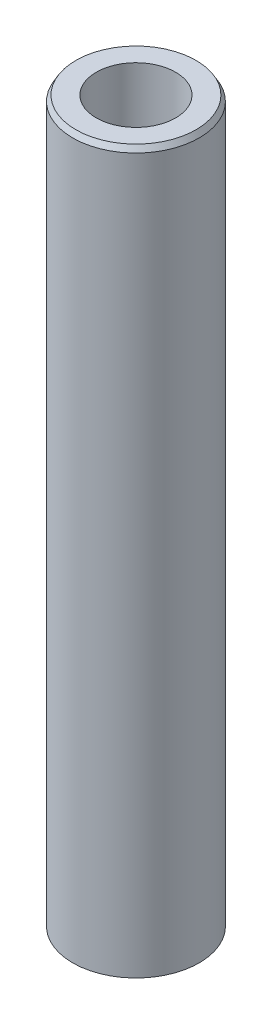
ISO-10303-21;
HEADER;
FILE_DESCRIPTION(('STEP AP214'),'2;1');
FILE_NAME('part.step','',(''),(''),'','','');
FILE_SCHEMA(('AUTOMOTIVE_DESIGN { 1 0 10303 214 1 1 1 1 }'));
ENDSEC;
DATA;
#1=APPLICATION_CONTEXT('core data for automotive mechanical design processes');
#2=APPLICATION_PROTOCOL_DEFINITION('international standard','automotive_design',2000,#1);
#3=PRODUCT_CONTEXT('',#1,'mechanical');
#4=PRODUCT('Part','Part','',(#3));
#5=PRODUCT_RELATED_PRODUCT_CATEGORY('part','',(#4));
#6=PRODUCT_DEFINITION_FORMATION('','',#4);
#7=PRODUCT_DEFINITION_CONTEXT('part definition',#1,'design');
#8=PRODUCT_DEFINITION('design','',#6,#7);
#9=PRODUCT_DEFINITION_SHAPE('','',#8);
#10=(LENGTH_UNIT() NAMED_UNIT(*) SI_UNIT(.MILLI.,.METRE.));
#11=(NAMED_UNIT(*) PLANE_ANGLE_UNIT() SI_UNIT($,.RADIAN.));
#12=(NAMED_UNIT(*) SI_UNIT($,.STERADIAN.) SOLID_ANGLE_UNIT());
#13=UNCERTAINTY_MEASURE_WITH_UNIT(LENGTH_MEASURE(1.E-05),#10,'distance_accuracy_value','');
#14=(GEOMETRIC_REPRESENTATION_CONTEXT(3) GLOBAL_UNCERTAINTY_ASSIGNED_CONTEXT((#13)) GLOBAL_UNIT_ASSIGNED_CONTEXT((#10,
#11,#12)) REPRESENTATION_CONTEXT('',''));
#15=CARTESIAN_POINT('',(0.,0.,0.));
#16=DIRECTION('',(0.,0.,1.));
#17=DIRECTION('',(1.,0.,0.));
#18=AXIS2_PLACEMENT_3D('',#15,#16,#17);
#19=CARTESIAN_POINT('',(0.,600.,0.));
#20=DIRECTION('',(0.,-1.,0.));
#21=DIRECTION('',(0.,0.,-1.));
#22=AXIS2_PLACEMENT_3D('',#19,#20,#21);
#23=CYLINDRICAL_SURFACE('',#22,52.5);
#24=CARTESIAN_POINT('',(0.,595.436138123828,0.));
#25=DIRECTION('',(0.,1.,0.));
#26=DIRECTION('',(0.,0.,1.));
#27=AXIS2_PLACEMENT_3D('',#24,#25,#26);
#28=CIRCLE('',#27,52.5);
#29=CARTESIAN_POINT('',(0.,595.436138123828,52.5));
#30=VERTEX_POINT('',#29);
#31=EDGE_CURVE('E50',#30,#30,#28,.F.);
#32=ORIENTED_EDGE('',*,*,#31,.T.);
#33=EDGE_LOOP('',(#32));
#34=FACE_BOUND('',#33,.T.);
#35=CARTESIAN_POINT('',(0.,2.63494688275223,0.));
#36=DIRECTION('',(0.,1.,0.));
#37=DIRECTION('',(0.,0.,1.));
#38=AXIS2_PLACEMENT_3D('',#35,#36,#37);
#39=CIRCLE('',#38,52.5);
#40=CARTESIAN_POINT('',(0.,2.63494688275223,52.5));
#41=VERTEX_POINT('',#40);
#42=EDGE_CURVE('E51',#41,#41,#39,.T.);
#43=ORIENTED_EDGE('',*,*,#42,.T.);
#44=EDGE_LOOP('',(#43));
#45=FACE_BOUND('',#44,.T.);
#46=ADVANCED_FACE('F39',(#34,#45),#23,.T.);
#47=CARTESIAN_POINT('',(0.,600.,0.));
#48=DIRECTION('',(0.,1.,0.));
#49=DIRECTION('',(0.,0.,1.));
#50=AXIS2_PLACEMENT_3D('',#47,#48,#49);
#51=PLANE('',#50);
#52=CARTESIAN_POINT('',(0.,600.,0.));
#53=DIRECTION('',(0.,1.,0.));
#54=DIRECTION('',(0.,0.,1.));
#55=AXIS2_PLACEMENT_3D('',#52,#53,#54);
#56=CIRCLE('',#55,49.8650531172475);
#57=CARTESIAN_POINT('',(0.,600.,49.8650531172475));
#58=VERTEX_POINT('',#57);
#59=EDGE_CURVE('E54',#58,#58,#56,.T.);
#60=ORIENTED_EDGE('',*,*,#59,.T.);
#61=EDGE_LOOP('',(#60));
#62=FACE_BOUND('',#61,.T.);
#63=CARTESIAN_POINT('',(0.,600.,0.));
#64=DIRECTION('',(0.,1.,0.));
#65=DIRECTION('',(0.,0.,1.));
#66=AXIS2_PLACEMENT_3D('',#63,#64,#65);
#67=CIRCLE('',#66,32.9066810284978);
#68=CARTESIAN_POINT('',(0.,600.,32.9066810284978));
#69=VERTEX_POINT('',#68);
#70=EDGE_CURVE('E58',#69,#69,#67,.T.);
#71=ORIENTED_EDGE('',*,*,#70,.F.);
#72=EDGE_LOOP('',(#71));
#73=FACE_BOUND('',#72,.T.);
#74=ADVANCED_FACE('F69',(#62,#73),#51,.T.);
#75=CARTESIAN_POINT('',(0.,0.,0.));
#76=DIRECTION('',(0.,1.,0.));
#77=DIRECTION('',(0.,0.,1.));
#78=AXIS2_PLACEMENT_3D('',#75,#76,#77);
#79=PLANE('',#78);
#80=CARTESIAN_POINT('',(0.,0.,0.));
#81=DIRECTION('',(0.,1.,0.));
#82=DIRECTION('',(0.,0.,1.));
#83=AXIS2_PLACEMENT_3D('',#80,#81,#82);
#84=CIRCLE('',#83,47.9361381238279);
#85=CARTESIAN_POINT('',(0.,0.,47.9361381238279));
#86=VERTEX_POINT('',#85);
#87=EDGE_CURVE('E10',#86,#86,#84,.F.);
#88=ORIENTED_EDGE('',*,*,#87,.T.);
#89=EDGE_LOOP('',(#88));
#90=FACE_BOUND('',#89,.T.);
#91=CARTESIAN_POINT('',(0.,0.,0.));
#92=DIRECTION('',(0.,1.,0.));
#93=DIRECTION('',(0.,0.,1.));
#94=AXIS2_PLACEMENT_3D('',#91,#92,#93);
#95=CIRCLE('',#94,32.9066810284978);
#96=CARTESIAN_POINT('',(0.,0.,32.9066810284978));
#97=VERTEX_POINT('',#96);
#98=EDGE_CURVE('E63',#97,#97,#95,.T.);
#99=ORIENTED_EDGE('',*,*,#98,.T.);
#100=EDGE_LOOP('',(#99));
#101=FACE_BOUND('',#100,.T.);
#102=ADVANCED_FACE('F75',(#90,#101),#79,.F.);
#103=CARTESIAN_POINT('',(0.,600.,0.));
#104=DIRECTION('',(0.,-1.,0.));
#105=DIRECTION('',(0.,0.,-1.));
#106=AXIS2_PLACEMENT_3D('',#103,#104,#105);
#107=CYLINDRICAL_SURFACE('',#106,32.9066810284978);
#108=ORIENTED_EDGE('',*,*,#70,.T.);
#109=EDGE_LOOP('',(#108));
#110=FACE_BOUND('',#109,.T.);
#111=ORIENTED_EDGE('',*,*,#98,.F.);
#112=EDGE_LOOP('',(#111));
#113=FACE_BOUND('',#112,.T.);
#114=ADVANCED_FACE('F70',(#110,#113),#107,.F.);
#115=CARTESIAN_POINT('',(0.,600.,0.));
#116=DIRECTION('',(0.,-1.,0.));
#117=DIRECTION('',(0.,0.,-1.));
#118=AXIS2_PLACEMENT_3D('',#115,#116,#117);
#119=CONICAL_SURFACE('',#118,49.8650531172475,0.523598775598296);
#120=ORIENTED_EDGE('',*,*,#31,.F.);
#121=EDGE_LOOP('',(#120));
#122=FACE_BOUND('',#121,.T.);
#123=ORIENTED_EDGE('',*,*,#59,.F.);
#124=EDGE_LOOP('',(#123));
#125=FACE_BOUND('',#124,.T.);
#126=ADVANCED_FACE('F81',(#122,#125),#119,.T.);
#127=CARTESIAN_POINT('',(0.,2.63494688275223,0.));
#128=DIRECTION('',(0.,1.,0.));
#129=DIRECTION('',(0.,0.,1.));
#130=AXIS2_PLACEMENT_3D('',#127,#128,#129);
#131=CONICAL_SURFACE('',#130,52.5,1.0471975511966);
#132=ORIENTED_EDGE('',*,*,#87,.F.);
#133=EDGE_LOOP('',(#132));
#134=FACE_BOUND('',#133,.T.);
#135=ORIENTED_EDGE('',*,*,#42,.F.);
#136=EDGE_LOOP('',(#135));
#137=FACE_BOUND('',#136,.T.);
#138=ADVANCED_FACE('F45',(#134,#137),#131,.T.);
#139=CLOSED_SHELL('',(#46,#74,#102,#114,#126,#138));
#140=MANIFOLD_SOLID_BREP('B2',#139);
#141=ADVANCED_BREP_SHAPE_REPRESENTATION('',(#18,#140),#14);
#142=SHAPE_DEFINITION_REPRESENTATION(#9,#141);
ENDSEC;
END-ISO-10303-21;
